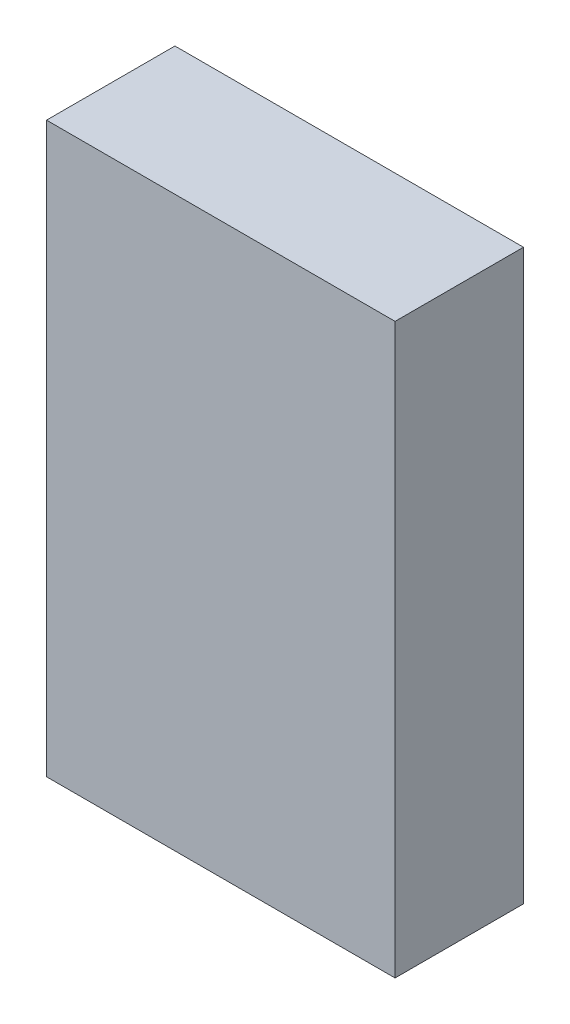
ISO-10303-21;
HEADER;
FILE_DESCRIPTION(('STEP AP214'),'2;1');
FILE_NAME('part.step','',(''),(''),'','','');
FILE_SCHEMA(('AUTOMOTIVE_DESIGN { 1 0 10303 214 1 1 1 1 }'));
ENDSEC;
DATA;
#1=APPLICATION_CONTEXT('core data for automotive mechanical design processes');
#2=APPLICATION_PROTOCOL_DEFINITION('international standard','automotive_design',2000,#1);
#3=PRODUCT_CONTEXT('',#1,'mechanical');
#4=PRODUCT('Part','Part','',(#3));
#5=PRODUCT_RELATED_PRODUCT_CATEGORY('part','',(#4));
#6=PRODUCT_DEFINITION_FORMATION('','',#4);
#7=PRODUCT_DEFINITION_CONTEXT('part definition',#1,'design');
#8=PRODUCT_DEFINITION('design','',#6,#7);
#9=PRODUCT_DEFINITION_SHAPE('','',#8);
#10=(LENGTH_UNIT() NAMED_UNIT(*) SI_UNIT(.MILLI.,.METRE.));
#11=(NAMED_UNIT(*) PLANE_ANGLE_UNIT() SI_UNIT($,.RADIAN.));
#12=(NAMED_UNIT(*) SI_UNIT($,.STERADIAN.) SOLID_ANGLE_UNIT());
#13=UNCERTAINTY_MEASURE_WITH_UNIT(LENGTH_MEASURE(1.E-05),#10,'distance_accuracy_value','');
#14=(GEOMETRIC_REPRESENTATION_CONTEXT(3) GLOBAL_UNCERTAINTY_ASSIGNED_CONTEXT((#13)) GLOBAL_UNIT_ASSIGNED_CONTEXT((#10,
#11,#12)) REPRESENTATION_CONTEXT('',''));
#15=CARTESIAN_POINT('',(0.,0.,0.));
#16=DIRECTION('',(0.,0.,1.));
#17=DIRECTION('',(1.,0.,0.));
#18=AXIS2_PLACEMENT_3D('',#15,#16,#17);
#19=CARTESIAN_POINT('',(19.,-31.,14.));
#20=DIRECTION('',(-1.,0.,0.));
#21=DIRECTION('',(0.,0.,1.));
#22=AXIS2_PLACEMENT_3D('',#19,#20,#21);
#23=PLANE('',#22);
#24=DIRECTION('',(0.,1.,0.));
#25=VECTOR('',#24,1.);
#26=CARTESIAN_POINT('',(19.,-31.,0.));
#27=LINE('',#26,#25);
#28=CARTESIAN_POINT('',(19.,-31.,0.));
#29=VERTEX_POINT('',#28);
#30=CARTESIAN_POINT('',(19.,31.,0.));
#31=VERTEX_POINT('',#30);
#32=EDGE_CURVE('E104',#29,#31,#27,.T.);
#33=ORIENTED_EDGE('',*,*,#32,.T.);
#34=DIRECTION('',(0.,0.,-1.));
#35=VECTOR('',#34,1.);
#36=CARTESIAN_POINT('',(19.,31.,14.));
#37=LINE('',#36,#35);
#38=CARTESIAN_POINT('',(19.,31.,14.));
#39=VERTEX_POINT('',#38);
#40=EDGE_CURVE('E11',#39,#31,#37,.T.);
#41=ORIENTED_EDGE('',*,*,#40,.F.);
#42=DIRECTION('',(0.,1.,0.));
#43=VECTOR('',#42,1.);
#44=CARTESIAN_POINT('',(19.,-31.,14.));
#45=LINE('',#44,#43);
#46=CARTESIAN_POINT('',(19.,-31.,14.));
#47=VERTEX_POINT('',#46);
#48=EDGE_CURVE('E92',#47,#39,#45,.T.);
#49=ORIENTED_EDGE('',*,*,#48,.F.);
#50=DIRECTION('',(0.,0.,-1.));
#51=VECTOR('',#50,1.);
#52=CARTESIAN_POINT('',(19.,-31.,14.));
#53=LINE('',#52,#51);
#54=EDGE_CURVE('E100',#47,#29,#53,.T.);
#55=ORIENTED_EDGE('',*,*,#54,.T.);
#56=EDGE_LOOP('',(#33,#41,#49,#55));
#57=FACE_BOUND('',#56,.T.);
#58=ADVANCED_FACE('F41',(#57),#23,.F.);
#59=CARTESIAN_POINT('',(-19.,31.,14.));
#60=DIRECTION('',(0.,-1.,0.));
#61=DIRECTION('',(0.,0.,-1.));
#62=AXIS2_PLACEMENT_3D('',#59,#60,#61);
#63=PLANE('',#62);
#64=DIRECTION('',(-1.,0.,0.));
#65=VECTOR('',#64,1.);
#66=CARTESIAN_POINT('',(-19.,31.,0.));
#67=LINE('',#66,#65);
#68=CARTESIAN_POINT('',(-19.,31.,0.));
#69=VERTEX_POINT('',#68);
#70=EDGE_CURVE('E96',#31,#69,#67,.T.);
#71=ORIENTED_EDGE('',*,*,#70,.T.);
#72=DIRECTION('',(0.,0.,-1.));
#73=VECTOR('',#72,1.);
#74=CARTESIAN_POINT('',(-19.,31.,14.));
#75=LINE('',#74,#73);
#76=CARTESIAN_POINT('',(-19.,31.,14.));
#77=VERTEX_POINT('',#76);
#78=EDGE_CURVE('E49',#77,#69,#75,.T.);
#79=ORIENTED_EDGE('',*,*,#78,.F.);
#80=DIRECTION('',(-1.,0.,0.));
#81=VECTOR('',#80,1.);
#82=CARTESIAN_POINT('',(-19.,31.,14.));
#83=LINE('',#82,#81);
#84=EDGE_CURVE('E87',#39,#77,#83,.T.);
#85=ORIENTED_EDGE('',*,*,#84,.F.);
#86=ORIENTED_EDGE('',*,*,#40,.T.);
#87=EDGE_LOOP('',(#71,#79,#85,#86));
#88=FACE_BOUND('',#87,.T.);
#89=ADVANCED_FACE('F95',(#88),#63,.F.);
#90=CARTESIAN_POINT('',(-19.,-31.,14.));
#91=DIRECTION('',(1.,0.,0.));
#92=DIRECTION('',(0.,0.,-1.));
#93=AXIS2_PLACEMENT_3D('',#90,#91,#92);
#94=PLANE('',#93);
#95=DIRECTION('',(0.,-1.,0.));
#96=VECTOR('',#95,1.);
#97=CARTESIAN_POINT('',(-19.,-31.,0.));
#98=LINE('',#97,#96);
#99=CARTESIAN_POINT('',(-19.,-31.,0.));
#100=VERTEX_POINT('',#99);
#101=EDGE_CURVE('E74',#69,#100,#98,.T.);
#102=ORIENTED_EDGE('',*,*,#101,.T.);
#103=DIRECTION('',(0.,0.,-1.));
#104=VECTOR('',#103,1.);
#105=CARTESIAN_POINT('',(-19.,-31.,14.));
#106=LINE('',#105,#104);
#107=CARTESIAN_POINT('',(-19.,-31.,14.));
#108=VERTEX_POINT('',#107);
#109=EDGE_CURVE('E97',#108,#100,#106,.T.);
#110=ORIENTED_EDGE('',*,*,#109,.F.);
#111=DIRECTION('',(0.,-1.,0.));
#112=VECTOR('',#111,1.);
#113=CARTESIAN_POINT('',(-19.,-31.,14.));
#114=LINE('',#113,#112);
#115=EDGE_CURVE('E90',#77,#108,#114,.T.);
#116=ORIENTED_EDGE('',*,*,#115,.F.);
#117=ORIENTED_EDGE('',*,*,#78,.T.);
#118=EDGE_LOOP('',(#102,#110,#116,#117));
#119=FACE_BOUND('',#118,.T.);
#120=ADVANCED_FACE('F98',(#119),#94,.F.);
#121=CARTESIAN_POINT('',(-19.,-31.,14.));
#122=DIRECTION('',(0.,1.,0.));
#123=DIRECTION('',(0.,0.,1.));
#124=AXIS2_PLACEMENT_3D('',#121,#122,#123);
#125=PLANE('',#124);
#126=DIRECTION('',(1.,0.,0.));
#127=VECTOR('',#126,1.);
#128=CARTESIAN_POINT('',(-19.,-31.,0.));
#129=LINE('',#128,#127);
#130=EDGE_CURVE('E80',#100,#29,#129,.T.);
#131=ORIENTED_EDGE('',*,*,#130,.T.);
#132=ORIENTED_EDGE('',*,*,#54,.F.);
#133=DIRECTION('',(1.,0.,0.));
#134=VECTOR('',#133,1.);
#135=CARTESIAN_POINT('',(-19.,-31.,14.));
#136=LINE('',#135,#134);
#137=EDGE_CURVE('E57',#108,#47,#136,.T.);
#138=ORIENTED_EDGE('',*,*,#137,.F.);
#139=ORIENTED_EDGE('',*,*,#109,.T.);
#140=EDGE_LOOP('',(#131,#132,#138,#139));
#141=FACE_BOUND('',#140,.T.);
#142=ADVANCED_FACE('F111',(#141),#125,.F.);
#143=CARTESIAN_POINT('',(0.,0.,14.));
#144=DIRECTION('',(0.,0.,-1.));
#145=DIRECTION('',(-1.,0.,0.));
#146=AXIS2_PLACEMENT_3D('',#143,#144,#145);
#147=PLANE('',#146);
#148=ORIENTED_EDGE('',*,*,#48,.T.);
#149=ORIENTED_EDGE('',*,*,#84,.T.);
#150=ORIENTED_EDGE('',*,*,#115,.T.);
#151=ORIENTED_EDGE('',*,*,#137,.T.);
#152=EDGE_LOOP('',(#148,#149,#150,#151));
#153=FACE_BOUND('',#152,.T.);
#154=ADVANCED_FACE('F88',(#153),#147,.F.);
#155=CARTESIAN_POINT('',(0.,0.,0.));
#156=DIRECTION('',(0.,0.,-1.));
#157=DIRECTION('',(-1.,0.,0.));
#158=AXIS2_PLACEMENT_3D('',#155,#156,#157);
#159=PLANE('',#158);
#160=ORIENTED_EDGE('',*,*,#32,.F.);
#161=ORIENTED_EDGE('',*,*,#130,.F.);
#162=ORIENTED_EDGE('',*,*,#101,.F.);
#163=ORIENTED_EDGE('',*,*,#70,.F.);
#164=EDGE_LOOP('',(#160,#161,#162,#163));
#165=FACE_BOUND('',#164,.T.);
#166=ADVANCED_FACE('F114',(#165),#159,.T.);
#167=CLOSED_SHELL('',(#58,#89,#120,#142,#154,#166));
#168=MANIFOLD_SOLID_BREP('B2',#167);
#169=ADVANCED_BREP_SHAPE_REPRESENTATION('',(#18,#168),#14);
#170=SHAPE_DEFINITION_REPRESENTATION(#9,#169);
ENDSEC;
END-ISO-10303-21;
